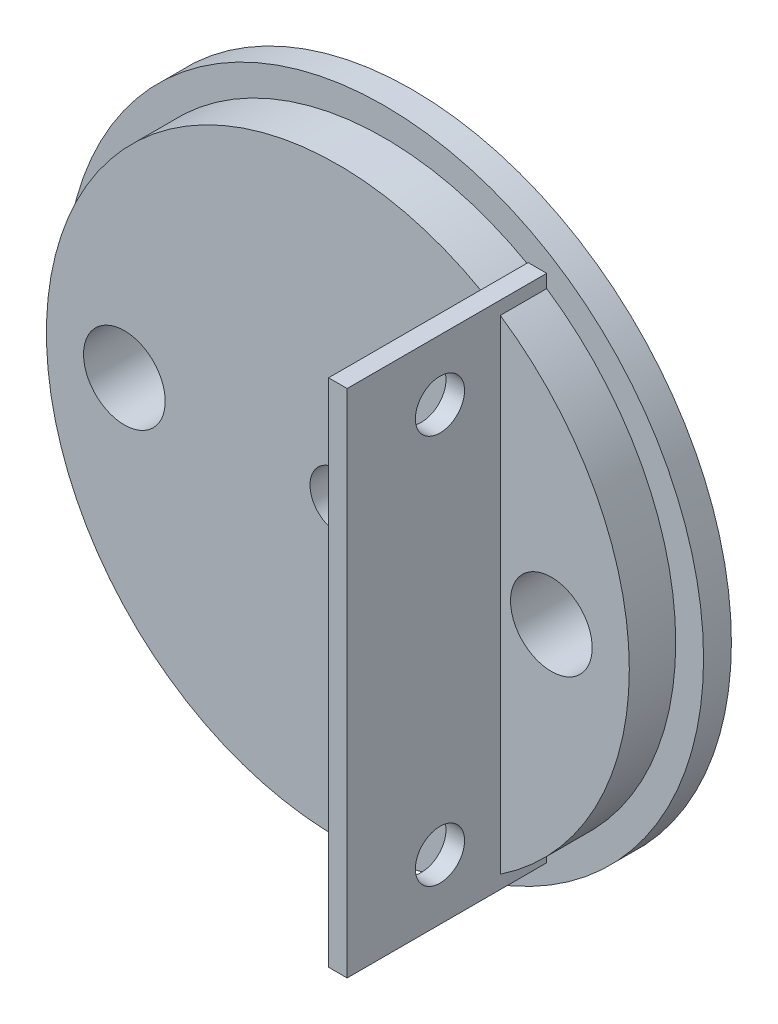
ISO-10303-21;
HEADER;
FILE_DESCRIPTION(('STEP AP214'),'2;1');
FILE_NAME('part.step','',(''),(''),'','','');
FILE_SCHEMA(('AUTOMOTIVE_DESIGN { 1 0 10303 214 1 1 1 1 }'));
ENDSEC;
DATA;
#1=APPLICATION_CONTEXT('core data for automotive mechanical design processes');
#2=APPLICATION_PROTOCOL_DEFINITION('international standard','automotive_design',2000,#1);
#3=PRODUCT_CONTEXT('',#1,'mechanical');
#4=PRODUCT('Part','Part','',(#3));
#5=PRODUCT_RELATED_PRODUCT_CATEGORY('part','',(#4));
#6=PRODUCT_DEFINITION_FORMATION('','',#4);
#7=PRODUCT_DEFINITION_CONTEXT('part definition',#1,'design');
#8=PRODUCT_DEFINITION('design','',#6,#7);
#9=PRODUCT_DEFINITION_SHAPE('','',#8);
#10=(LENGTH_UNIT() NAMED_UNIT(*) SI_UNIT(.MILLI.,.METRE.));
#11=(NAMED_UNIT(*) PLANE_ANGLE_UNIT() SI_UNIT($,.RADIAN.));
#12=(NAMED_UNIT(*) SI_UNIT($,.STERADIAN.) SOLID_ANGLE_UNIT());
#13=UNCERTAINTY_MEASURE_WITH_UNIT(LENGTH_MEASURE(1.E-05),#10,'distance_accuracy_value','');
#14=(GEOMETRIC_REPRESENTATION_CONTEXT(3) GLOBAL_UNCERTAINTY_ASSIGNED_CONTEXT((#13)) GLOBAL_UNIT_ASSIGNED_CONTEXT((#10,
#11,#12)) REPRESENTATION_CONTEXT('',''));
#15=CARTESIAN_POINT('',(0.,0.,0.));
#16=DIRECTION('',(0.,0.,1.));
#17=DIRECTION('',(1.,0.,0.));
#18=AXIS2_PLACEMENT_3D('',#15,#16,#17);
#19=CARTESIAN_POINT('',(0.,0.,-323.));
#20=DIRECTION('',(0.,0.,-1.));
#21=DIRECTION('',(-1.,0.,0.));
#22=AXIS2_PLACEMENT_3D('',#19,#20,#21);
#23=PLANE('',#22);
#24=CARTESIAN_POINT('',(0.,0.,-323.));
#25=DIRECTION('',(0.,0.,-1.));
#26=DIRECTION('',(-1.,0.,0.));
#27=AXIS2_PLACEMENT_3D('',#24,#25,#26);
#28=CIRCLE('',#27,3.);
#29=CARTESIAN_POINT('',(-3.,0.,-323.));
#30=VERTEX_POINT('',#29);
#31=EDGE_CURVE('E146',#30,#30,#28,.T.);
#32=ORIENTED_EDGE('',*,*,#31,.F.);
#33=EDGE_LOOP('',(#32));
#34=FACE_BOUND('',#33,.T.);
#35=CARTESIAN_POINT('',(0.,0.,-323.));
#36=DIRECTION('',(0.,0.,-1.));
#37=DIRECTION('',(-1.,0.,0.));
#38=AXIS2_PLACEMENT_3D('',#35,#36,#37);
#39=CIRCLE('',#38,4.5);
#40=CARTESIAN_POINT('',(-4.5,0.,-323.));
#41=VERTEX_POINT('',#40);
#42=EDGE_CURVE('E194',#41,#41,#39,.T.);
#43=ORIENTED_EDGE('',*,*,#42,.T.);
#44=EDGE_LOOP('',(#43));
#45=FACE_BOUND('',#44,.T.);
#46=ADVANCED_FACE('F33',(#34,#45),#23,.T.);
#47=CARTESIAN_POINT('',(0.,0.,-318.));
#48=DIRECTION('',(0.,0.,-1.));
#49=DIRECTION('',(-1.,0.,0.));
#50=AXIS2_PLACEMENT_3D('',#47,#48,#49);
#51=PLANE('',#50);
#52=CARTESIAN_POINT('',(23.,0.,-318.));
#53=DIRECTION('',(0.,0.,-1.));
#54=DIRECTION('',(-1.,0.,0.));
#55=AXIS2_PLACEMENT_3D('',#52,#53,#54);
#56=CIRCLE('',#55,4.4);
#57=CARTESIAN_POINT('',(18.6,0.,-318.));
#58=VERTEX_POINT('',#57);
#59=EDGE_CURVE('E142',#58,#58,#56,.T.);
#60=ORIENTED_EDGE('',*,*,#59,.T.);
#61=EDGE_LOOP('',(#60));
#62=FACE_BOUND('',#61,.T.);
#63=CARTESIAN_POINT('',(0.,0.,-318.));
#64=DIRECTION('',(0.,0.,-1.));
#65=DIRECTION('',(-1.,0.,0.));
#66=AXIS2_PLACEMENT_3D('',#63,#64,#65);
#67=CIRCLE('',#66,31.4);
#68=CARTESIAN_POINT('',(17.5,26.071248531668,-318.));
#69=VERTEX_POINT('',#68);
#70=CARTESIAN_POINT('',(17.5,-26.071248531668,-318.));
#71=VERTEX_POINT('',#70);
#72=EDGE_CURVE('E105',#69,#71,#67,.T.);
#73=ORIENTED_EDGE('',*,*,#72,.F.);
#74=DIRECTION('',(0.,-1.,0.));
#75=VECTOR('',#74,1.);
#76=CARTESIAN_POINT('',(17.5,0.,-318.));
#77=LINE('',#76,#75);
#78=EDGE_CURVE('E48',#69,#71,#77,.T.);
#79=ORIENTED_EDGE('',*,*,#78,.T.);
#80=EDGE_LOOP('',(#73,#79));
#81=FACE_BOUND('',#80,.T.);
#82=ADVANCED_FACE('F227',(#62,#81),#51,.F.);
#83=CARTESIAN_POINT('',(0.,0.,-323.));
#84=DIRECTION('',(0.,0.,1.));
#85=DIRECTION('',(1.,0.,0.));
#86=AXIS2_PLACEMENT_3D('',#83,#84,#85);
#87=CYLINDRICAL_SURFACE('',#86,31.4);
#88=CARTESIAN_POINT('',(0.,0.,-323.));
#89=DIRECTION('',(0.,0.,-1.));
#90=DIRECTION('',(-1.,0.,0.));
#91=AXIS2_PLACEMENT_3D('',#88,#89,#90);
#92=CIRCLE('',#91,31.4);
#93=CARTESIAN_POINT('',(17.5,26.071248531668,-323.));
#94=VERTEX_POINT('',#93);
#95=CARTESIAN_POINT('',(17.5,-26.071248531668,-323.));
#96=VERTEX_POINT('',#95);
#97=EDGE_CURVE('E104',#94,#96,#92,.T.);
#98=ORIENTED_EDGE('',*,*,#97,.F.);
#99=DIRECTION('',(0.,0.,1.));
#100=VECTOR('',#99,1.);
#101=CARTESIAN_POINT('',(17.5,26.071248531668,-323.));
#102=LINE('',#101,#100);
#103=EDGE_CURVE('E11',#94,#69,#102,.T.);
#104=ORIENTED_EDGE('',*,*,#103,.T.);
#105=ORIENTED_EDGE('',*,*,#72,.T.);
#106=DIRECTION('',(0.,0.,1.));
#107=VECTOR('',#106,1.);
#108=CARTESIAN_POINT('',(17.5,-26.071248531668,-323.));
#109=LINE('',#108,#107);
#110=EDGE_CURVE('E41',#71,#96,#109,.F.);
#111=ORIENTED_EDGE('',*,*,#110,.T.);
#112=EDGE_LOOP('',(#98,#104,#105,#111));
#113=FACE_BOUND('',#112,.T.);
#114=ADVANCED_FACE('F157',(#113),#87,.T.);
#115=CARTESIAN_POINT('',(15.5,-27.3076912242687,-318.));
#116=VERTEX_POINT('',#115);
#117=CARTESIAN_POINT('',(15.5,27.3076912242687,-318.));
#118=VERTEX_POINT('',#117);
#119=EDGE_CURVE('E149',#116,#118,#67,.T.);
#120=ORIENTED_EDGE('',*,*,#119,.F.);
#121=DIRECTION('',(0.,1.,0.));
#122=VECTOR('',#121,1.);
#123=CARTESIAN_POINT('',(15.5,0.,-318.));
#124=LINE('',#123,#122);
#125=EDGE_CURVE('E113',#116,#118,#124,.T.);
#126=ORIENTED_EDGE('',*,*,#125,.T.);
#127=EDGE_LOOP('',(#120,#126));
#128=FACE_BOUND('',#127,.T.);
#129=CARTESIAN_POINT('',(0.,0.,-318.));
#130=DIRECTION('',(0.,0.,-1.));
#131=DIRECTION('',(-1.,0.,0.));
#132=AXIS2_PLACEMENT_3D('',#129,#130,#131);
#133=CIRCLE('',#132,3.);
#134=CARTESIAN_POINT('',(-3.,0.,-318.));
#135=VERTEX_POINT('',#134);
#136=EDGE_CURVE('E145',#135,#135,#133,.T.);
#137=ORIENTED_EDGE('',*,*,#136,.T.);
#138=EDGE_LOOP('',(#137));
#139=FACE_BOUND('',#138,.T.);
#140=CARTESIAN_POINT('',(-23.,0.,-318.));
#141=DIRECTION('',(0.,0.,-1.));
#142=DIRECTION('',(-1.,0.,0.));
#143=AXIS2_PLACEMENT_3D('',#140,#141,#142);
#144=CIRCLE('',#143,4.4);
#145=CARTESIAN_POINT('',(-27.4,0.,-318.));
#146=VERTEX_POINT('',#145);
#147=EDGE_CURVE('E139',#146,#146,#144,.T.);
#148=ORIENTED_EDGE('',*,*,#147,.T.);
#149=EDGE_LOOP('',(#148));
#150=FACE_BOUND('',#149,.T.);
#151=ADVANCED_FACE('F234',(#128,#139,#150),#51,.F.);
#152=CARTESIAN_POINT('',(15.5,-27.3076912242687,-323.));
#153=VERTEX_POINT('',#152);
#154=CARTESIAN_POINT('',(15.5,27.3076912242687,-323.));
#155=VERTEX_POINT('',#154);
#156=EDGE_CURVE('E95',#153,#155,#92,.T.);
#157=ORIENTED_EDGE('',*,*,#156,.F.);
#158=DIRECTION('',(0.,0.,1.));
#159=VECTOR('',#158,1.);
#160=CARTESIAN_POINT('',(15.5,-27.3076912242687,-323.));
#161=LINE('',#160,#159);
#162=EDGE_CURVE('E98',#153,#116,#161,.T.);
#163=ORIENTED_EDGE('',*,*,#162,.T.);
#164=ORIENTED_EDGE('',*,*,#119,.T.);
#165=DIRECTION('',(0.,0.,1.));
#166=VECTOR('',#165,1.);
#167=CARTESIAN_POINT('',(15.5,27.3076912242687,-323.));
#168=LINE('',#167,#166);
#169=EDGE_CURVE('E100',#118,#155,#168,.F.);
#170=ORIENTED_EDGE('',*,*,#169,.T.);
#171=EDGE_LOOP('',(#157,#163,#164,#170));
#172=FACE_BOUND('',#171,.T.);
#173=ADVANCED_FACE('F35',(#172),#87,.T.);
#174=CARTESIAN_POINT('',(0.,0.,-323.));
#175=DIRECTION('',(0.,0.,1.));
#176=DIRECTION('',(1.,0.,0.));
#177=AXIS2_PLACEMENT_3D('',#174,#175,#176);
#178=CYLINDRICAL_SURFACE('',#177,3.);
#179=ORIENTED_EDGE('',*,*,#31,.T.);
#180=EDGE_LOOP('',(#179));
#181=FACE_BOUND('',#180,.T.);
#182=ORIENTED_EDGE('',*,*,#136,.F.);
#183=EDGE_LOOP('',(#182));
#184=FACE_BOUND('',#183,.T.);
#185=ADVANCED_FACE('F238',(#181,#184),#178,.F.);
#186=CARTESIAN_POINT('',(23.,0.,-323.));
#187=DIRECTION('',(0.,0.,1.));
#188=DIRECTION('',(1.,0.,0.));
#189=AXIS2_PLACEMENT_3D('',#186,#187,#188);
#190=CYLINDRICAL_SURFACE('',#189,4.4);
#191=ORIENTED_EDGE('',*,*,#59,.F.);
#192=EDGE_LOOP('',(#191));
#193=FACE_BOUND('',#192,.T.);
#194=CARTESIAN_POINT('',(23.,0.,-326.));
#195=DIRECTION('',(0.,0.,-1.));
#196=DIRECTION('',(-1.,0.,0.));
#197=AXIS2_PLACEMENT_3D('',#194,#195,#196);
#198=CIRCLE('',#197,4.4);
#199=CARTESIAN_POINT('',(18.6,0.,-326.));
#200=VERTEX_POINT('',#199);
#201=EDGE_CURVE('E202',#200,#200,#198,.T.);
#202=ORIENTED_EDGE('',*,*,#201,.T.);
#203=EDGE_LOOP('',(#202));
#204=FACE_BOUND('',#203,.T.);
#205=ADVANCED_FACE('F206',(#193,#204),#190,.F.);
#206=CARTESIAN_POINT('',(-23.,0.,-323.));
#207=DIRECTION('',(0.,0.,1.));
#208=DIRECTION('',(1.,0.,0.));
#209=AXIS2_PLACEMENT_3D('',#206,#207,#208);
#210=CYLINDRICAL_SURFACE('',#209,4.4);
#211=ORIENTED_EDGE('',*,*,#147,.F.);
#212=EDGE_LOOP('',(#211));
#213=FACE_BOUND('',#212,.T.);
#214=CARTESIAN_POINT('',(-23.,0.,-326.));
#215=DIRECTION('',(0.,0.,-1.));
#216=DIRECTION('',(-1.,0.,0.));
#217=AXIS2_PLACEMENT_3D('',#214,#215,#216);
#218=CIRCLE('',#217,4.4);
#219=CARTESIAN_POINT('',(-27.4,0.,-326.));
#220=VERTEX_POINT('',#219);
#221=EDGE_CURVE('E197',#220,#220,#218,.T.);
#222=ORIENTED_EDGE('',*,*,#221,.T.);
#223=EDGE_LOOP('',(#222));
#224=FACE_BOUND('',#223,.T.);
#225=ADVANCED_FACE('F251',(#213,#224),#210,.F.);
#226=CARTESIAN_POINT('',(17.5,27.5000000000001,-301.5));
#227=DIRECTION('',(1.,0.,0.));
#228=DIRECTION('',(0.,0.,-1.));
#229=AXIS2_PLACEMENT_3D('',#226,#227,#228);
#230=PLANE('',#229);
#231=CARTESIAN_POINT('',(17.5,-21.,-311.5));
#232=DIRECTION('',(1.,0.,0.));
#233=DIRECTION('',(0.,0.,-1.));
#234=AXIS2_PLACEMENT_3D('',#231,#232,#233);
#235=CIRCLE('',#234,2.64999999999807);
#236=CARTESIAN_POINT('',(17.5,-21.,-314.149999999998));
#237=VERTEX_POINT('',#236);
#238=EDGE_CURVE('E164',#237,#237,#235,.T.);
#239=ORIENTED_EDGE('',*,*,#238,.F.);
#240=EDGE_LOOP('',(#239));
#241=FACE_BOUND('',#240,.T.);
#242=CARTESIAN_POINT('',(17.5,21.,-311.5));
#243=DIRECTION('',(1.,0.,0.));
#244=DIRECTION('',(0.,0.,-1.));
#245=AXIS2_PLACEMENT_3D('',#242,#243,#244);
#246=CIRCLE('',#245,2.64999999999807);
#247=CARTESIAN_POINT('',(17.5,21.,-314.149999999998));
#248=VERTEX_POINT('',#247);
#249=EDGE_CURVE('E178',#248,#248,#246,.T.);
#250=ORIENTED_EDGE('',*,*,#249,.F.);
#251=EDGE_LOOP('',(#250));
#252=FACE_BOUND('',#251,.T.);
#253=ORIENTED_EDGE('',*,*,#103,.F.);
#254=DIRECTION('',(0.,-1.,0.));
#255=VECTOR('',#254,1.);
#256=CARTESIAN_POINT('',(17.5,27.5000000000001,-323.));
#257=LINE('',#256,#255);
#258=CARTESIAN_POINT('',(17.5,27.5000000000001,-323.));
#259=VERTEX_POINT('',#258);
#260=EDGE_CURVE('E162',#259,#94,#257,.T.);
#261=ORIENTED_EDGE('',*,*,#260,.F.);
#262=DIRECTION('',(0.,0.,-1.));
#263=VECTOR('',#262,1.);
#264=CARTESIAN_POINT('',(17.5,27.5000000000001,-301.5));
#265=LINE('',#264,#263);
#266=CARTESIAN_POINT('',(17.5,27.5000000000001,-301.5));
#267=VERTEX_POINT('',#266);
#268=EDGE_CURVE('E128',#267,#259,#265,.T.);
#269=ORIENTED_EDGE('',*,*,#268,.F.);
#270=DIRECTION('',(0.,-1.,0.));
#271=VECTOR('',#270,1.);
#272=CARTESIAN_POINT('',(17.5,27.5000000000001,-301.5));
#273=LINE('',#272,#271);
#274=CARTESIAN_POINT('',(17.5,-27.4999999999999,-301.5));
#275=VERTEX_POINT('',#274);
#276=EDGE_CURVE('E123',#267,#275,#273,.T.);
#277=ORIENTED_EDGE('',*,*,#276,.T.);
#278=DIRECTION('',(0.,0.,-1.));
#279=VECTOR('',#278,1.);
#280=CARTESIAN_POINT('',(17.5,-27.4999999999999,-301.5));
#281=LINE('',#280,#279);
#282=CARTESIAN_POINT('',(17.5,-27.4999999999999,-323.));
#283=VERTEX_POINT('',#282);
#284=EDGE_CURVE('E134',#275,#283,#281,.T.);
#285=ORIENTED_EDGE('',*,*,#284,.T.);
#286=EDGE_CURVE('E160',#96,#283,#257,.T.);
#287=ORIENTED_EDGE('',*,*,#286,.F.);
#288=ORIENTED_EDGE('',*,*,#110,.F.);
#289=ORIENTED_EDGE('',*,*,#78,.F.);
#290=EDGE_LOOP('',(#253,#261,#269,#277,#285,#287,#288,#289));
#291=FACE_BOUND('',#290,.T.);
#292=ADVANCED_FACE('F254',(#241,#252,#291),#230,.T.);
#293=CARTESIAN_POINT('',(15.5,27.5000000000001,-301.5));
#294=DIRECTION('',(-1.,0.,0.));
#295=DIRECTION('',(0.,0.,1.));
#296=AXIS2_PLACEMENT_3D('',#293,#294,#295);
#297=PLANE('',#296);
#298=CARTESIAN_POINT('',(15.5,-21.,-311.5));
#299=DIRECTION('',(-1.,0.,0.));
#300=DIRECTION('',(0.,0.,1.));
#301=AXIS2_PLACEMENT_3D('',#298,#299,#300);
#302=CIRCLE('',#301,2.64999999999807);
#303=CARTESIAN_POINT('',(15.5,-21.,-308.850000000002));
#304=VERTEX_POINT('',#303);
#305=EDGE_CURVE('E181',#304,#304,#302,.T.);
#306=ORIENTED_EDGE('',*,*,#305,.F.);
#307=EDGE_LOOP('',(#306));
#308=FACE_BOUND('',#307,.T.);
#309=CARTESIAN_POINT('',(15.5,21.,-311.5));
#310=DIRECTION('',(-1.,0.,0.));
#311=DIRECTION('',(0.,0.,1.));
#312=AXIS2_PLACEMENT_3D('',#309,#310,#311);
#313=CIRCLE('',#312,2.64999999999807);
#314=CARTESIAN_POINT('',(15.5,21.,-308.850000000002));
#315=VERTEX_POINT('',#314);
#316=EDGE_CURVE('E182',#315,#315,#313,.T.);
#317=ORIENTED_EDGE('',*,*,#316,.F.);
#318=EDGE_LOOP('',(#317));
#319=FACE_BOUND('',#318,.T.);
#320=ORIENTED_EDGE('',*,*,#162,.F.);
#321=DIRECTION('',(0.,1.,0.));
#322=VECTOR('',#321,1.);
#323=CARTESIAN_POINT('',(15.5,27.5000000000001,-323.));
#324=LINE('',#323,#322);
#325=CARTESIAN_POINT('',(15.5,-27.4999999999999,-323.));
#326=VERTEX_POINT('',#325);
#327=EDGE_CURVE('E110',#326,#153,#324,.T.);
#328=ORIENTED_EDGE('',*,*,#327,.F.);
#329=DIRECTION('',(0.,0.,-1.));
#330=VECTOR('',#329,1.);
#331=CARTESIAN_POINT('',(15.5,-27.4999999999999,-301.5));
#332=LINE('',#331,#330);
#333=CARTESIAN_POINT('',(15.5,-27.4999999999999,-301.5));
#334=VERTEX_POINT('',#333);
#335=EDGE_CURVE('E132',#334,#326,#332,.T.);
#336=ORIENTED_EDGE('',*,*,#335,.F.);
#337=DIRECTION('',(0.,1.,0.));
#338=VECTOR('',#337,1.);
#339=CARTESIAN_POINT('',(15.5,27.5000000000001,-301.5));
#340=LINE('',#339,#338);
#341=CARTESIAN_POINT('',(15.5,27.5000000000001,-301.5));
#342=VERTEX_POINT('',#341);
#343=EDGE_CURVE('E168',#334,#342,#340,.T.);
#344=ORIENTED_EDGE('',*,*,#343,.T.);
#345=DIRECTION('',(0.,0.,-1.));
#346=VECTOR('',#345,1.);
#347=CARTESIAN_POINT('',(15.5,27.5000000000001,-301.5));
#348=LINE('',#347,#346);
#349=CARTESIAN_POINT('',(15.5,27.5000000000001,-323.));
#350=VERTEX_POINT('',#349);
#351=EDGE_CURVE('E130',#342,#350,#348,.T.);
#352=ORIENTED_EDGE('',*,*,#351,.T.);
#353=EDGE_CURVE('E120',#155,#350,#324,.T.);
#354=ORIENTED_EDGE('',*,*,#353,.F.);
#355=ORIENTED_EDGE('',*,*,#169,.F.);
#356=ORIENTED_EDGE('',*,*,#125,.F.);
#357=EDGE_LOOP('',(#320,#328,#336,#344,#352,#354,#355,#356));
#358=FACE_BOUND('',#357,.T.);
#359=ADVANCED_FACE('F109',(#308,#319,#358),#297,.T.);
#360=CARTESIAN_POINT('',(17.5,27.5000000000001,-301.5));
#361=DIRECTION('',(0.,1.,0.));
#362=DIRECTION('',(0.,0.,1.));
#363=AXIS2_PLACEMENT_3D('',#360,#361,#362);
#364=PLANE('',#363);
#365=DIRECTION('',(1.,0.,0.));
#366=VECTOR('',#365,1.);
#367=CARTESIAN_POINT('',(17.5,27.5000000000001,-323.));
#368=LINE('',#367,#366);
#369=EDGE_CURVE('E119',#350,#259,#368,.T.);
#370=ORIENTED_EDGE('',*,*,#369,.F.);
#371=ORIENTED_EDGE('',*,*,#351,.F.);
#372=DIRECTION('',(1.,0.,0.));
#373=VECTOR('',#372,1.);
#374=CARTESIAN_POINT('',(17.5,27.5000000000001,-301.5));
#375=LINE('',#374,#373);
#376=EDGE_CURVE('E136',#342,#267,#375,.T.);
#377=ORIENTED_EDGE('',*,*,#376,.T.);
#378=ORIENTED_EDGE('',*,*,#268,.T.);
#379=EDGE_LOOP('',(#370,#371,#377,#378));
#380=FACE_BOUND('',#379,.T.);
#381=ADVANCED_FACE('F268',(#380),#364,.T.);
#382=CARTESIAN_POINT('',(17.5,-27.4999999999999,-301.5));
#383=DIRECTION('',(0.,-1.,0.));
#384=DIRECTION('',(0.,0.,-1.));
#385=AXIS2_PLACEMENT_3D('',#382,#383,#384);
#386=PLANE('',#385);
#387=DIRECTION('',(-1.,0.,0.));
#388=VECTOR('',#387,1.);
#389=CARTESIAN_POINT('',(17.5,-27.4999999999999,-323.));
#390=LINE('',#389,#388);
#391=EDGE_CURVE('E118',#283,#326,#390,.T.);
#392=ORIENTED_EDGE('',*,*,#391,.F.);
#393=ORIENTED_EDGE('',*,*,#284,.F.);
#394=DIRECTION('',(-1.,0.,0.));
#395=VECTOR('',#394,1.);
#396=CARTESIAN_POINT('',(17.5,-27.4999999999999,-301.5));
#397=LINE('',#396,#395);
#398=EDGE_CURVE('E171',#275,#334,#397,.T.);
#399=ORIENTED_EDGE('',*,*,#398,.T.);
#400=ORIENTED_EDGE('',*,*,#335,.T.);
#401=EDGE_LOOP('',(#392,#393,#399,#400));
#402=FACE_BOUND('',#401,.T.);
#403=ADVANCED_FACE('F264',(#402),#386,.T.);
#404=CARTESIAN_POINT('',(0.,0.,-301.5));
#405=DIRECTION('',(0.,0.,-1.));
#406=DIRECTION('',(-1.,0.,0.));
#407=AXIS2_PLACEMENT_3D('',#404,#405,#406);
#408=PLANE('',#407);
#409=ORIENTED_EDGE('',*,*,#276,.F.);
#410=ORIENTED_EDGE('',*,*,#376,.F.);
#411=ORIENTED_EDGE('',*,*,#343,.F.);
#412=ORIENTED_EDGE('',*,*,#398,.F.);
#413=EDGE_LOOP('',(#409,#410,#411,#412));
#414=FACE_BOUND('',#413,.T.);
#415=ADVANCED_FACE('F267',(#414),#408,.F.);
#416=CARTESIAN_POINT('',(37.,21.,-311.5));
#417=DIRECTION('',(-1.,0.,0.));
#418=DIRECTION('',(0.,0.,1.));
#419=AXIS2_PLACEMENT_3D('',#416,#417,#418);
#420=CYLINDRICAL_SURFACE('',#419,2.64999999999807);
#421=ORIENTED_EDGE('',*,*,#249,.T.);
#422=EDGE_LOOP('',(#421));
#423=FACE_BOUND('',#422,.T.);
#424=ORIENTED_EDGE('',*,*,#316,.T.);
#425=EDGE_LOOP('',(#424));
#426=FACE_BOUND('',#425,.T.);
#427=ADVANCED_FACE('F278',(#423,#426),#420,.F.);
#428=CARTESIAN_POINT('',(37.,-21.,-311.5));
#429=DIRECTION('',(-1.,0.,0.));
#430=DIRECTION('',(0.,0.,1.));
#431=AXIS2_PLACEMENT_3D('',#428,#429,#430);
#432=CYLINDRICAL_SURFACE('',#431,2.64999999999807);
#433=ORIENTED_EDGE('',*,*,#238,.T.);
#434=EDGE_LOOP('',(#433));
#435=FACE_BOUND('',#434,.T.);
#436=ORIENTED_EDGE('',*,*,#305,.T.);
#437=EDGE_LOOP('',(#436));
#438=FACE_BOUND('',#437,.T.);
#439=ADVANCED_FACE('F220',(#435,#438),#432,.F.);
#440=CARTESIAN_POINT('',(0.,0.,-323.));
#441=DIRECTION('',(0.,0.,-1.));
#442=DIRECTION('',(-1.,0.,0.));
#443=AXIS2_PLACEMENT_3D('',#440,#441,#442);
#444=PLANE('',#443);
#445=CARTESIAN_POINT('',(0.,0.,-323.));
#446=DIRECTION('',(0.,0.,-1.));
#447=DIRECTION('',(-1.,0.,0.));
#448=AXIS2_PLACEMENT_3D('',#445,#446,#447);
#449=CIRCLE('',#448,34.4);
#450=CARTESIAN_POINT('',(-34.4,0.,-323.));
#451=VERTEX_POINT('',#450);
#452=EDGE_CURVE('E188',#451,#451,#449,.T.);
#453=ORIENTED_EDGE('',*,*,#452,.F.);
#454=EDGE_LOOP('',(#453));
#455=FACE_BOUND('',#454,.T.);
#456=ORIENTED_EDGE('',*,*,#327,.T.);
#457=ORIENTED_EDGE('',*,*,#156,.T.);
#458=ORIENTED_EDGE('',*,*,#353,.T.);
#459=ORIENTED_EDGE('',*,*,#369,.T.);
#460=ORIENTED_EDGE('',*,*,#260,.T.);
#461=ORIENTED_EDGE('',*,*,#97,.T.);
#462=ORIENTED_EDGE('',*,*,#286,.T.);
#463=ORIENTED_EDGE('',*,*,#391,.T.);
#464=EDGE_LOOP('',(#456,#457,#458,#459,#460,#461,#462,#463));
#465=FACE_BOUND('',#464,.T.);
#466=ADVANCED_FACE('F115',(#455,#465),#444,.F.);
#467=CARTESIAN_POINT('',(0.,0.,-326.));
#468=DIRECTION('',(0.,0.,-1.));
#469=DIRECTION('',(-1.,0.,0.));
#470=AXIS2_PLACEMENT_3D('',#467,#468,#469);
#471=PLANE('',#470);
#472=ORIENTED_EDGE('',*,*,#221,.F.);
#473=EDGE_LOOP('',(#472));
#474=FACE_BOUND('',#473,.T.);
#475=CARTESIAN_POINT('',(0.,0.,-326.));
#476=DIRECTION('',(0.,0.,-1.));
#477=DIRECTION('',(-1.,0.,0.));
#478=AXIS2_PLACEMENT_3D('',#475,#476,#477);
#479=CIRCLE('',#478,34.4);
#480=CARTESIAN_POINT('',(-34.4,0.,-326.));
#481=VERTEX_POINT('',#480);
#482=EDGE_CURVE('E185',#481,#481,#479,.T.);
#483=ORIENTED_EDGE('',*,*,#482,.T.);
#484=EDGE_LOOP('',(#483));
#485=FACE_BOUND('',#484,.T.);
#486=CARTESIAN_POINT('',(0.,0.,-326.));
#487=DIRECTION('',(0.,0.,-1.));
#488=DIRECTION('',(-1.,0.,0.));
#489=AXIS2_PLACEMENT_3D('',#486,#487,#488);
#490=CIRCLE('',#489,4.5);
#491=CARTESIAN_POINT('',(-4.5,0.,-326.));
#492=VERTEX_POINT('',#491);
#493=EDGE_CURVE('E191',#492,#492,#490,.T.);
#494=ORIENTED_EDGE('',*,*,#493,.F.);
#495=EDGE_LOOP('',(#494));
#496=FACE_BOUND('',#495,.T.);
#497=ORIENTED_EDGE('',*,*,#201,.F.);
#498=EDGE_LOOP('',(#497));
#499=FACE_BOUND('',#498,.T.);
#500=ADVANCED_FACE('F208',(#474,#485,#496,#499),#471,.T.);
#501=CARTESIAN_POINT('',(0.,0.,-326.));
#502=DIRECTION('',(0.,0.,1.));
#503=DIRECTION('',(1.,0.,0.));
#504=AXIS2_PLACEMENT_3D('',#501,#502,#503);
#505=CYLINDRICAL_SURFACE('',#504,34.4);
#506=ORIENTED_EDGE('',*,*,#482,.F.);
#507=EDGE_LOOP('',(#506));
#508=FACE_BOUND('',#507,.T.);
#509=ORIENTED_EDGE('',*,*,#452,.T.);
#510=EDGE_LOOP('',(#509));
#511=FACE_BOUND('',#510,.T.);
#512=ADVANCED_FACE('F210',(#508,#511),#505,.T.);
#513=CARTESIAN_POINT('',(0.,0.,-326.));
#514=DIRECTION('',(0.,0.,1.));
#515=DIRECTION('',(1.,0.,0.));
#516=AXIS2_PLACEMENT_3D('',#513,#514,#515);
#517=CYLINDRICAL_SURFACE('',#516,4.5);
#518=ORIENTED_EDGE('',*,*,#493,.T.);
#519=EDGE_LOOP('',(#518));
#520=FACE_BOUND('',#519,.T.);
#521=ORIENTED_EDGE('',*,*,#42,.F.);
#522=EDGE_LOOP('',(#521));
#523=FACE_BOUND('',#522,.T.);
#524=ADVANCED_FACE('F217',(#520,#523),#517,.F.);
#525=CLOSED_SHELL('',(#46,#82,#114,#151,#173,#185,#205,#225,#292,#359,#381,#403,#415,#427,#439,
#466,#500,#512,#524));
#526=MANIFOLD_SOLID_BREP('B2',#525);
#527=ADVANCED_BREP_SHAPE_REPRESENTATION('',(#18,#526),#14);
#528=SHAPE_DEFINITION_REPRESENTATION(#9,#527);
ENDSEC;
END-ISO-10303-21;
